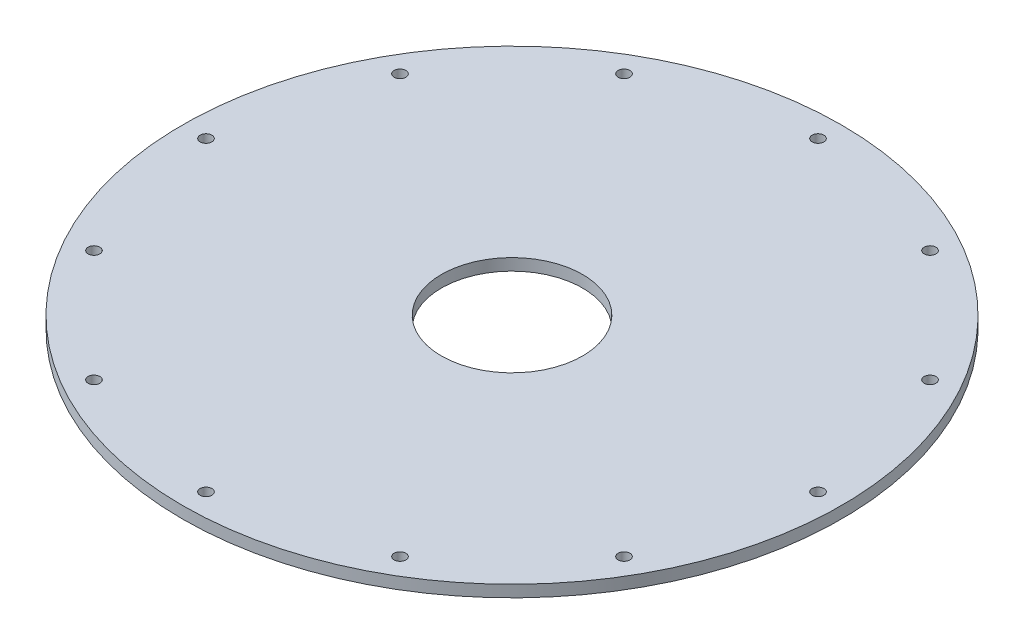
ISO-10303-21;
HEADER;
FILE_DESCRIPTION(('STEP AP214'),'2;1');
FILE_NAME('part.step','',(''),(''),'','','');
FILE_SCHEMA(('AUTOMOTIVE_DESIGN { 1 0 10303 214 1 1 1 1 }'));
ENDSEC;
DATA;
#1=APPLICATION_CONTEXT('core data for automotive mechanical design processes');
#2=APPLICATION_PROTOCOL_DEFINITION('international standard','automotive_design',2000,#1);
#3=PRODUCT_CONTEXT('',#1,'mechanical');
#4=PRODUCT('Part','Part','',(#3));
#5=PRODUCT_RELATED_PRODUCT_CATEGORY('part','',(#4));
#6=PRODUCT_DEFINITION_FORMATION('','',#4);
#7=PRODUCT_DEFINITION_CONTEXT('part definition',#1,'design');
#8=PRODUCT_DEFINITION('design','',#6,#7);
#9=PRODUCT_DEFINITION_SHAPE('','',#8);
#10=(LENGTH_UNIT() NAMED_UNIT(*) SI_UNIT(.MILLI.,.METRE.));
#11=(NAMED_UNIT(*) PLANE_ANGLE_UNIT() SI_UNIT($,.RADIAN.));
#12=(NAMED_UNIT(*) SI_UNIT($,.STERADIAN.) SOLID_ANGLE_UNIT());
#13=UNCERTAINTY_MEASURE_WITH_UNIT(LENGTH_MEASURE(1.E-05),#10,'distance_accuracy_value','');
#14=(GEOMETRIC_REPRESENTATION_CONTEXT(3) GLOBAL_UNCERTAINTY_ASSIGNED_CONTEXT((#13)) GLOBAL_UNIT_ASSIGNED_CONTEXT((#10,
#11,#12)) REPRESENTATION_CONTEXT('',''));
#15=CARTESIAN_POINT('',(0.,0.,0.));
#16=DIRECTION('',(0.,0.,1.));
#17=DIRECTION('',(1.,0.,0.));
#18=AXIS2_PLACEMENT_3D('',#15,#16,#17);
#19=CARTESIAN_POINT('',(-44.45,0.,0.));
#20=DIRECTION('',(0.,-1.,0.));
#21=DIRECTION('',(0.,0.,-1.));
#22=AXIS2_PLACEMENT_3D('',#19,#20,#21);
#23=PLANE('',#22);
#24=CARTESIAN_POINT('',(1.11561489392428E-13,0.,-41.275));
#25=DIRECTION('',(0.,1.,0.));
#26=DIRECTION('',(0.,0.,1.));
#27=AXIS2_PLACEMENT_3D('',#24,#25,#26);
#28=CIRCLE('',#27,0.79375);
#29=CARTESIAN_POINT('',(1.11561489392428E-13,0.,-40.48125));
#30=VERTEX_POINT('',#29);
#31=EDGE_CURVE('E69',#30,#30,#28,.T.);
#32=ORIENTED_EDGE('',*,*,#31,.T.);
#33=EDGE_LOOP('',(#32));
#34=FACE_BOUND('',#33,.T.);
#35=CARTESIAN_POINT('',(-20.6374999999999,0.,-35.7451985412027));
#36=DIRECTION('',(0.,1.,0.));
#37=DIRECTION('',(0.,0.,1.));
#38=AXIS2_PLACEMENT_3D('',#35,#36,#37);
#39=CIRCLE('',#38,0.793749999999999);
#40=CARTESIAN_POINT('',(-20.6374999999999,0.,-34.9514485412027));
#41=VERTEX_POINT('',#40);
#42=EDGE_CURVE('E63',#41,#41,#39,.T.);
#43=ORIENTED_EDGE('',*,*,#42,.T.);
#44=EDGE_LOOP('',(#43));
#45=FACE_BOUND('',#44,.T.);
#46=CARTESIAN_POINT('',(-35.7451985412027,0.,-20.6375));
#47=DIRECTION('',(0.,1.,0.));
#48=DIRECTION('',(0.,0.,1.));
#49=AXIS2_PLACEMENT_3D('',#46,#47,#48);
#50=CIRCLE('',#49,0.793750000000003);
#51=CARTESIAN_POINT('',(-35.7451985412027,0.,-19.84375));
#52=VERTEX_POINT('',#51);
#53=EDGE_CURVE('E57',#52,#52,#50,.T.);
#54=ORIENTED_EDGE('',*,*,#53,.T.);
#55=EDGE_LOOP('',(#54));
#56=FACE_BOUND('',#55,.T.);
#57=CARTESIAN_POINT('',(-41.275,0.,0.));
#58=DIRECTION('',(0.,1.,0.));
#59=DIRECTION('',(0.,0.,1.));
#60=AXIS2_PLACEMENT_3D('',#57,#58,#59);
#61=CIRCLE('',#60,0.793750000000003);
#62=CARTESIAN_POINT('',(-41.275,0.,0.793750000000008));
#63=VERTEX_POINT('',#62);
#64=EDGE_CURVE('E51',#63,#63,#61,.T.);
#65=ORIENTED_EDGE('',*,*,#64,.T.);
#66=EDGE_LOOP('',(#65));
#67=FACE_BOUND('',#66,.T.);
#68=CARTESIAN_POINT('',(0.,0.,0.));
#69=DIRECTION('',(0.,1.,0.));
#70=DIRECTION('',(0.,0.,1.));
#71=AXIS2_PLACEMENT_3D('',#68,#69,#70);
#72=CIRCLE('',#71,9.525);
#73=CARTESIAN_POINT('',(0.,0.,9.525));
#74=VERTEX_POINT('',#73);
#75=EDGE_CURVE('E42',#74,#74,#72,.T.);
#76=ORIENTED_EDGE('',*,*,#75,.T.);
#77=EDGE_LOOP('',(#76));
#78=FACE_BOUND('',#77,.T.);
#79=CARTESIAN_POINT('',(0.,0.,0.));
#80=DIRECTION('',(0.,1.,0.));
#81=DIRECTION('',(0.,0.,1.));
#82=AXIS2_PLACEMENT_3D('',#79,#80,#81);
#83=CIRCLE('',#82,44.45);
#84=CARTESIAN_POINT('',(0.,0.,44.45));
#85=VERTEX_POINT('',#84);
#86=EDGE_CURVE('E46',#85,#85,#83,.T.);
#87=ORIENTED_EDGE('',*,*,#86,.F.);
#88=EDGE_LOOP('',(#87));
#89=FACE_BOUND('',#88,.T.);
#90=CARTESIAN_POINT('',(20.6375000000001,0.,-35.7451985412026));
#91=DIRECTION('',(0.,1.,0.));
#92=DIRECTION('',(0.,0.,1.));
#93=AXIS2_PLACEMENT_3D('',#90,#91,#92);
#94=CIRCLE('',#93,0.793749999999999);
#95=CARTESIAN_POINT('',(20.6375000000001,0.,-34.9514485412026));
#96=VERTEX_POINT('',#95);
#97=EDGE_CURVE('E75',#96,#96,#94,.T.);
#98=ORIENTED_EDGE('',*,*,#97,.T.);
#99=EDGE_LOOP('',(#98));
#100=FACE_BOUND('',#99,.T.);
#101=CARTESIAN_POINT('',(35.7451985412028,0.,-20.6374999999998));
#102=DIRECTION('',(0.,1.,0.));
#103=DIRECTION('',(0.,0.,1.));
#104=AXIS2_PLACEMENT_3D('',#101,#102,#103);
#105=CIRCLE('',#104,0.793750000000003);
#106=CARTESIAN_POINT('',(35.7451985412028,0.,-19.8437499999998));
#107=VERTEX_POINT('',#106);
#108=EDGE_CURVE('E81',#107,#107,#105,.T.);
#109=ORIENTED_EDGE('',*,*,#108,.T.);
#110=EDGE_LOOP('',(#109));
#111=FACE_BOUND('',#110,.T.);
#112=CARTESIAN_POINT('',(41.275,0.,2.28177708448336E-13));
#113=DIRECTION('',(0.,1.,0.));
#114=DIRECTION('',(0.,0.,1.));
#115=AXIS2_PLACEMENT_3D('',#112,#113,#114);
#116=CIRCLE('',#115,0.793750000000003);
#117=CARTESIAN_POINT('',(41.275,0.,0.793750000000231));
#118=VERTEX_POINT('',#117);
#119=EDGE_CURVE('E87',#118,#118,#116,.T.);
#120=ORIENTED_EDGE('',*,*,#119,.T.);
#121=EDGE_LOOP('',(#120));
#122=FACE_BOUND('',#121,.T.);
#123=CARTESIAN_POINT('',(35.7451985412026,0.,20.6375000000002));
#124=DIRECTION('',(0.,1.,0.));
#125=DIRECTION('',(0.,0.,1.));
#126=AXIS2_PLACEMENT_3D('',#123,#124,#125);
#127=CIRCLE('',#126,0.793750000000003);
#128=CARTESIAN_POINT('',(35.7451985412026,0.,21.4312500000002));
#129=VERTEX_POINT('',#128);
#130=EDGE_CURVE('E93',#129,#129,#127,.T.);
#131=ORIENTED_EDGE('',*,*,#130,.T.);
#132=EDGE_LOOP('',(#131));
#133=FACE_BOUND('',#132,.T.);
#134=CARTESIAN_POINT('',(20.6374999999997,0.,35.7451985412029));
#135=DIRECTION('',(0.,1.,0.));
#136=DIRECTION('',(0.,0.,1.));
#137=AXIS2_PLACEMENT_3D('',#134,#135,#136);
#138=CIRCLE('',#137,0.793749999999999);
#139=CARTESIAN_POINT('',(20.6374999999997,0.,36.5389485412029));
#140=VERTEX_POINT('',#139);
#141=EDGE_CURVE('E99',#140,#140,#138,.T.);
#142=ORIENTED_EDGE('',*,*,#141,.T.);
#143=EDGE_LOOP('',(#142));
#144=FACE_BOUND('',#143,.T.);
#145=CARTESIAN_POINT('',(-3.53958818572525E-13,0.,41.275));
#146=DIRECTION('',(0.,1.,0.));
#147=DIRECTION('',(0.,0.,1.));
#148=AXIS2_PLACEMENT_3D('',#145,#146,#147);
#149=CIRCLE('',#148,0.79375);
#150=CARTESIAN_POINT('',(-3.53958818572525E-13,0.,42.06875));
#151=VERTEX_POINT('',#150);
#152=EDGE_CURVE('E105',#151,#151,#149,.T.);
#153=ORIENTED_EDGE('',*,*,#152,.T.);
#154=EDGE_LOOP('',(#153));
#155=FACE_BOUND('',#154,.T.);
#156=CARTESIAN_POINT('',(-20.6375000000004,0.,35.7451985412025));
#157=DIRECTION('',(0.,1.,0.));
#158=DIRECTION('',(0.,0.,1.));
#159=AXIS2_PLACEMENT_3D('',#156,#157,#158);
#160=CIRCLE('',#159,0.793749999999999);
#161=CARTESIAN_POINT('',(-20.6375000000004,0.,36.5389485412025));
#162=VERTEX_POINT('',#161);
#163=EDGE_CURVE('E111',#162,#162,#160,.T.);
#164=ORIENTED_EDGE('',*,*,#163,.T.);
#165=EDGE_LOOP('',(#164));
#166=FACE_BOUND('',#165,.T.);
#167=CARTESIAN_POINT('',(-35.7451985412029,0.,20.6374999999996));
#168=DIRECTION('',(0.,1.,0.));
#169=DIRECTION('',(0.,0.,1.));
#170=AXIS2_PLACEMENT_3D('',#167,#168,#169);
#171=CIRCLE('',#170,0.793750000000003);
#172=CARTESIAN_POINT('',(-35.7451985412029,0.,21.4312499999996));
#173=VERTEX_POINT('',#172);
#174=EDGE_CURVE('E117',#173,#173,#171,.T.);
#175=ORIENTED_EDGE('',*,*,#174,.T.);
#176=EDGE_LOOP('',(#175));
#177=FACE_BOUND('',#176,.T.);
#178=ADVANCED_FACE('F31',(#34,#45,#56,#67,#78,#89,#100,#111,#122,#133,#144,#155,#166,#177),#23,.T.);
#179=CARTESIAN_POINT('',(0.,55.,0.));
#180=DIRECTION('',(0.,1.,0.));
#181=DIRECTION('',(0.,0.,1.));
#182=AXIS2_PLACEMENT_3D('',#179,#180,#181);
#183=CYLINDRICAL_SURFACE('',#182,44.45);
#184=ORIENTED_EDGE('',*,*,#86,.T.);
#185=EDGE_LOOP('',(#184));
#186=FACE_BOUND('',#185,.T.);
#187=CARTESIAN_POINT('',(0.,1.5875,0.));
#188=DIRECTION('',(0.,1.,0.));
#189=DIRECTION('',(0.,0.,1.));
#190=AXIS2_PLACEMENT_3D('',#187,#188,#189);
#191=CIRCLE('',#190,44.45);
#192=CARTESIAN_POINT('',(0.,1.5875,44.45));
#193=VERTEX_POINT('',#192);
#194=EDGE_CURVE('E10',#193,#193,#191,.T.);
#195=ORIENTED_EDGE('',*,*,#194,.F.);
#196=EDGE_LOOP('',(#195));
#197=FACE_BOUND('',#196,.T.);
#198=ADVANCED_FACE('F33',(#186,#197),#183,.T.);
#199=CARTESIAN_POINT('',(-44.45,1.5875,0.));
#200=DIRECTION('',(0.,1.,0.));
#201=DIRECTION('',(0.,0.,1.));
#202=AXIS2_PLACEMENT_3D('',#199,#200,#201);
#203=PLANE('',#202);
#204=CARTESIAN_POINT('',(-35.7451985412029,1.5875,20.6374999999996));
#205=DIRECTION('',(0.,1.,0.));
#206=DIRECTION('',(0.,0.,1.));
#207=AXIS2_PLACEMENT_3D('',#204,#205,#206);
#208=CIRCLE('',#207,0.793750000000003);
#209=CARTESIAN_POINT('',(-35.7451985412029,1.5875,21.4312499999996));
#210=VERTEX_POINT('',#209);
#211=EDGE_CURVE('E120',#210,#210,#208,.T.);
#212=ORIENTED_EDGE('',*,*,#211,.F.);
#213=EDGE_LOOP('',(#212));
#214=FACE_BOUND('',#213,.T.);
#215=CARTESIAN_POINT('',(-20.6375000000004,1.5875,35.7451985412025));
#216=DIRECTION('',(0.,1.,0.));
#217=DIRECTION('',(0.,0.,1.));
#218=AXIS2_PLACEMENT_3D('',#215,#216,#217);
#219=CIRCLE('',#218,0.793749999999999);
#220=CARTESIAN_POINT('',(-20.6375000000004,1.5875,36.5389485412025));
#221=VERTEX_POINT('',#220);
#222=EDGE_CURVE('E114',#221,#221,#219,.T.);
#223=ORIENTED_EDGE('',*,*,#222,.F.);
#224=EDGE_LOOP('',(#223));
#225=FACE_BOUND('',#224,.T.);
#226=CARTESIAN_POINT('',(-3.53958818572525E-13,1.5875,41.275));
#227=DIRECTION('',(0.,1.,0.));
#228=DIRECTION('',(0.,0.,1.));
#229=AXIS2_PLACEMENT_3D('',#226,#227,#228);
#230=CIRCLE('',#229,0.79375);
#231=CARTESIAN_POINT('',(-3.53958818572525E-13,1.5875,42.06875));
#232=VERTEX_POINT('',#231);
#233=EDGE_CURVE('E108',#232,#232,#230,.T.);
#234=ORIENTED_EDGE('',*,*,#233,.F.);
#235=EDGE_LOOP('',(#234));
#236=FACE_BOUND('',#235,.T.);
#237=CARTESIAN_POINT('',(20.6374999999997,1.5875,35.7451985412029));
#238=DIRECTION('',(0.,1.,0.));
#239=DIRECTION('',(0.,0.,1.));
#240=AXIS2_PLACEMENT_3D('',#237,#238,#239);
#241=CIRCLE('',#240,0.793749999999999);
#242=CARTESIAN_POINT('',(20.6374999999997,1.5875,36.5389485412029));
#243=VERTEX_POINT('',#242);
#244=EDGE_CURVE('E102',#243,#243,#241,.T.);
#245=ORIENTED_EDGE('',*,*,#244,.F.);
#246=EDGE_LOOP('',(#245));
#247=FACE_BOUND('',#246,.T.);
#248=CARTESIAN_POINT('',(35.7451985412026,1.5875,20.6375000000002));
#249=DIRECTION('',(0.,1.,0.));
#250=DIRECTION('',(0.,0.,1.));
#251=AXIS2_PLACEMENT_3D('',#248,#249,#250);
#252=CIRCLE('',#251,0.793750000000003);
#253=CARTESIAN_POINT('',(35.7451985412026,1.5875,21.4312500000002));
#254=VERTEX_POINT('',#253);
#255=EDGE_CURVE('E96',#254,#254,#252,.T.);
#256=ORIENTED_EDGE('',*,*,#255,.F.);
#257=EDGE_LOOP('',(#256));
#258=FACE_BOUND('',#257,.T.);
#259=CARTESIAN_POINT('',(41.275,1.5875,2.28177708448336E-13));
#260=DIRECTION('',(0.,1.,0.));
#261=DIRECTION('',(0.,0.,1.));
#262=AXIS2_PLACEMENT_3D('',#259,#260,#261);
#263=CIRCLE('',#262,0.793750000000003);
#264=CARTESIAN_POINT('',(41.275,1.5875,0.793750000000231));
#265=VERTEX_POINT('',#264);
#266=EDGE_CURVE('E90',#265,#265,#263,.T.);
#267=ORIENTED_EDGE('',*,*,#266,.F.);
#268=EDGE_LOOP('',(#267));
#269=FACE_BOUND('',#268,.T.);
#270=CARTESIAN_POINT('',(35.7451985412028,1.5875,-20.6374999999998));
#271=DIRECTION('',(0.,1.,0.));
#272=DIRECTION('',(0.,0.,1.));
#273=AXIS2_PLACEMENT_3D('',#270,#271,#272);
#274=CIRCLE('',#273,0.793750000000003);
#275=CARTESIAN_POINT('',(35.7451985412028,1.5875,-19.8437499999998));
#276=VERTEX_POINT('',#275);
#277=EDGE_CURVE('E84',#276,#276,#274,.T.);
#278=ORIENTED_EDGE('',*,*,#277,.F.);
#279=EDGE_LOOP('',(#278));
#280=FACE_BOUND('',#279,.T.);
#281=CARTESIAN_POINT('',(20.6375000000001,1.5875,-35.7451985412026));
#282=DIRECTION('',(0.,1.,0.));
#283=DIRECTION('',(0.,0.,1.));
#284=AXIS2_PLACEMENT_3D('',#281,#282,#283);
#285=CIRCLE('',#284,0.793749999999999);
#286=CARTESIAN_POINT('',(20.6375000000001,1.5875,-34.9514485412026));
#287=VERTEX_POINT('',#286);
#288=EDGE_CURVE('E78',#287,#287,#285,.T.);
#289=ORIENTED_EDGE('',*,*,#288,.F.);
#290=EDGE_LOOP('',(#289));
#291=FACE_BOUND('',#290,.T.);
#292=CARTESIAN_POINT('',(1.11561489392428E-13,1.5875,-41.275));
#293=DIRECTION('',(0.,1.,0.));
#294=DIRECTION('',(0.,0.,1.));
#295=AXIS2_PLACEMENT_3D('',#292,#293,#294);
#296=CIRCLE('',#295,0.79375);
#297=CARTESIAN_POINT('',(1.11561489392428E-13,1.5875,-40.48125));
#298=VERTEX_POINT('',#297);
#299=EDGE_CURVE('E72',#298,#298,#296,.T.);
#300=ORIENTED_EDGE('',*,*,#299,.F.);
#301=EDGE_LOOP('',(#300));
#302=FACE_BOUND('',#301,.T.);
#303=CARTESIAN_POINT('',(-20.6374999999999,1.5875,-35.7451985412027));
#304=DIRECTION('',(0.,1.,0.));
#305=DIRECTION('',(0.,0.,1.));
#306=AXIS2_PLACEMENT_3D('',#303,#304,#305);
#307=CIRCLE('',#306,0.793749999999999);
#308=CARTESIAN_POINT('',(-20.6374999999999,1.5875,-34.9514485412027));
#309=VERTEX_POINT('',#308);
#310=EDGE_CURVE('E66',#309,#309,#307,.T.);
#311=ORIENTED_EDGE('',*,*,#310,.F.);
#312=EDGE_LOOP('',(#311));
#313=FACE_BOUND('',#312,.T.);
#314=CARTESIAN_POINT('',(-35.7451985412027,1.5875,-20.6375));
#315=DIRECTION('',(0.,1.,0.));
#316=DIRECTION('',(0.,0.,1.));
#317=AXIS2_PLACEMENT_3D('',#314,#315,#316);
#318=CIRCLE('',#317,0.793750000000003);
#319=CARTESIAN_POINT('',(-35.7451985412027,1.5875,-19.84375));
#320=VERTEX_POINT('',#319);
#321=EDGE_CURVE('E60',#320,#320,#318,.T.);
#322=ORIENTED_EDGE('',*,*,#321,.F.);
#323=EDGE_LOOP('',(#322));
#324=FACE_BOUND('',#323,.T.);
#325=CARTESIAN_POINT('',(-41.275,1.5875,0.));
#326=DIRECTION('',(0.,1.,0.));
#327=DIRECTION('',(0.,0.,1.));
#328=AXIS2_PLACEMENT_3D('',#325,#326,#327);
#329=CIRCLE('',#328,0.793750000000003);
#330=CARTESIAN_POINT('',(-41.275,1.5875,0.793750000000008));
#331=VERTEX_POINT('',#330);
#332=EDGE_CURVE('E54',#331,#331,#329,.T.);
#333=ORIENTED_EDGE('',*,*,#332,.F.);
#334=EDGE_LOOP('',(#333));
#335=FACE_BOUND('',#334,.T.);
#336=ORIENTED_EDGE('',*,*,#194,.T.);
#337=EDGE_LOOP('',(#336));
#338=FACE_BOUND('',#337,.T.);
#339=CARTESIAN_POINT('',(0.,1.5875,0.));
#340=DIRECTION('',(0.,1.,0.));
#341=DIRECTION('',(0.,0.,1.));
#342=AXIS2_PLACEMENT_3D('',#339,#340,#341);
#343=CIRCLE('',#342,9.525);
#344=CARTESIAN_POINT('',(0.,1.5875,9.525));
#345=VERTEX_POINT('',#344);
#346=EDGE_CURVE('E38',#345,#345,#343,.T.);
#347=ORIENTED_EDGE('',*,*,#346,.F.);
#348=EDGE_LOOP('',(#347));
#349=FACE_BOUND('',#348,.T.);
#350=ADVANCED_FACE('F126',(#214,#225,#236,#247,#258,#269,#280,#291,#302,#313,#324,#335,#338,
#349),#203,.T.);
#351=CARTESIAN_POINT('',(0.,55.,0.));
#352=DIRECTION('',(0.,1.,0.));
#353=DIRECTION('',(0.,0.,1.));
#354=AXIS2_PLACEMENT_3D('',#351,#352,#353);
#355=CYLINDRICAL_SURFACE('',#354,9.525);
#356=ORIENTED_EDGE('',*,*,#346,.T.);
#357=EDGE_LOOP('',(#356));
#358=FACE_BOUND('',#357,.T.);
#359=ORIENTED_EDGE('',*,*,#75,.F.);
#360=EDGE_LOOP('',(#359));
#361=FACE_BOUND('',#360,.T.);
#362=ADVANCED_FACE('F129',(#358,#361),#355,.F.);
#363=CARTESIAN_POINT('',(-41.275,1.5875,0.));
#364=DIRECTION('',(0.,1.,0.));
#365=DIRECTION('',(0.,0.,1.));
#366=AXIS2_PLACEMENT_3D('',#363,#364,#365);
#367=CYLINDRICAL_SURFACE('',#366,0.793750000000003);
#368=ORIENTED_EDGE('',*,*,#64,.F.);
#369=EDGE_LOOP('',(#368));
#370=FACE_BOUND('',#369,.T.);
#371=ORIENTED_EDGE('',*,*,#332,.T.);
#372=EDGE_LOOP('',(#371));
#373=FACE_BOUND('',#372,.T.);
#374=ADVANCED_FACE('F153',(#370,#373),#367,.F.);
#375=CARTESIAN_POINT('',(-35.7451985412027,1.5875,-20.6375));
#376=DIRECTION('',(0.,1.,0.));
#377=DIRECTION('',(0.,0.,1.));
#378=AXIS2_PLACEMENT_3D('',#375,#376,#377);
#379=CYLINDRICAL_SURFACE('',#378,0.793750000000003);
#380=ORIENTED_EDGE('',*,*,#53,.F.);
#381=EDGE_LOOP('',(#380));
#382=FACE_BOUND('',#381,.T.);
#383=ORIENTED_EDGE('',*,*,#321,.T.);
#384=EDGE_LOOP('',(#383));
#385=FACE_BOUND('',#384,.T.);
#386=ADVANCED_FACE('F155',(#382,#385),#379,.F.);
#387=CARTESIAN_POINT('',(-20.6374999999999,1.5875,-35.7451985412027));
#388=DIRECTION('',(0.,1.,0.));
#389=DIRECTION('',(0.,0.,1.));
#390=AXIS2_PLACEMENT_3D('',#387,#388,#389);
#391=CYLINDRICAL_SURFACE('',#390,0.793749999999999);
#392=ORIENTED_EDGE('',*,*,#42,.F.);
#393=EDGE_LOOP('',(#392));
#394=FACE_BOUND('',#393,.T.);
#395=ORIENTED_EDGE('',*,*,#310,.T.);
#396=EDGE_LOOP('',(#395));
#397=FACE_BOUND('',#396,.T.);
#398=ADVANCED_FACE('F162',(#394,#397),#391,.F.);
#399=CARTESIAN_POINT('',(1.11561489392428E-13,1.5875,-41.275));
#400=DIRECTION('',(0.,1.,0.));
#401=DIRECTION('',(0.,0.,1.));
#402=AXIS2_PLACEMENT_3D('',#399,#400,#401);
#403=CYLINDRICAL_SURFACE('',#402,0.79375);
#404=ORIENTED_EDGE('',*,*,#31,.F.);
#405=EDGE_LOOP('',(#404));
#406=FACE_BOUND('',#405,.T.);
#407=ORIENTED_EDGE('',*,*,#299,.T.);
#408=EDGE_LOOP('',(#407));
#409=FACE_BOUND('',#408,.T.);
#410=ADVANCED_FACE('F233',(#406,#409),#403,.F.);
#411=CARTESIAN_POINT('',(20.6375000000001,1.5875,-35.7451985412026));
#412=DIRECTION('',(0.,1.,0.));
#413=DIRECTION('',(0.,0.,1.));
#414=AXIS2_PLACEMENT_3D('',#411,#412,#413);
#415=CYLINDRICAL_SURFACE('',#414,0.793749999999999);
#416=ORIENTED_EDGE('',*,*,#97,.F.);
#417=EDGE_LOOP('',(#416));
#418=FACE_BOUND('',#417,.T.);
#419=ORIENTED_EDGE('',*,*,#288,.T.);
#420=EDGE_LOOP('',(#419));
#421=FACE_BOUND('',#420,.T.);
#422=ADVANCED_FACE('F229',(#418,#421),#415,.F.);
#423=CARTESIAN_POINT('',(35.7451985412028,1.5875,-20.6374999999998));
#424=DIRECTION('',(0.,1.,0.));
#425=DIRECTION('',(0.,0.,1.));
#426=AXIS2_PLACEMENT_3D('',#423,#424,#425);
#427=CYLINDRICAL_SURFACE('',#426,0.793750000000003);
#428=ORIENTED_EDGE('',*,*,#108,.F.);
#429=EDGE_LOOP('',(#428));
#430=FACE_BOUND('',#429,.T.);
#431=ORIENTED_EDGE('',*,*,#277,.T.);
#432=EDGE_LOOP('',(#431));
#433=FACE_BOUND('',#432,.T.);
#434=ADVANCED_FACE('F225',(#430,#433),#427,.F.);
#435=CARTESIAN_POINT('',(41.275,1.5875,2.28177708448336E-13));
#436=DIRECTION('',(0.,1.,0.));
#437=DIRECTION('',(0.,0.,1.));
#438=AXIS2_PLACEMENT_3D('',#435,#436,#437);
#439=CYLINDRICAL_SURFACE('',#438,0.793750000000003);
#440=ORIENTED_EDGE('',*,*,#119,.F.);
#441=EDGE_LOOP('',(#440));
#442=FACE_BOUND('',#441,.T.);
#443=ORIENTED_EDGE('',*,*,#266,.T.);
#444=EDGE_LOOP('',(#443));
#445=FACE_BOUND('',#444,.T.);
#446=ADVANCED_FACE('F221',(#442,#445),#439,.F.);
#447=CARTESIAN_POINT('',(35.7451985412026,1.5875,20.6375000000002));
#448=DIRECTION('',(0.,1.,0.));
#449=DIRECTION('',(0.,0.,1.));
#450=AXIS2_PLACEMENT_3D('',#447,#448,#449);
#451=CYLINDRICAL_SURFACE('',#450,0.793750000000003);
#452=ORIENTED_EDGE('',*,*,#130,.F.);
#453=EDGE_LOOP('',(#452));
#454=FACE_BOUND('',#453,.T.);
#455=ORIENTED_EDGE('',*,*,#255,.T.);
#456=EDGE_LOOP('',(#455));
#457=FACE_BOUND('',#456,.T.);
#458=ADVANCED_FACE('F217',(#454,#457),#451,.F.);
#459=CARTESIAN_POINT('',(20.6374999999997,1.5875,35.7451985412029));
#460=DIRECTION('',(0.,1.,0.));
#461=DIRECTION('',(0.,0.,1.));
#462=AXIS2_PLACEMENT_3D('',#459,#460,#461);
#463=CYLINDRICAL_SURFACE('',#462,0.793749999999999);
#464=ORIENTED_EDGE('',*,*,#141,.F.);
#465=EDGE_LOOP('',(#464));
#466=FACE_BOUND('',#465,.T.);
#467=ORIENTED_EDGE('',*,*,#244,.T.);
#468=EDGE_LOOP('',(#467));
#469=FACE_BOUND('',#468,.T.);
#470=ADVANCED_FACE('F213',(#466,#469),#463,.F.);
#471=CARTESIAN_POINT('',(-3.53958818572525E-13,1.5875,41.275));
#472=DIRECTION('',(0.,1.,0.));
#473=DIRECTION('',(0.,0.,1.));
#474=AXIS2_PLACEMENT_3D('',#471,#472,#473);
#475=CYLINDRICAL_SURFACE('',#474,0.79375);
#476=ORIENTED_EDGE('',*,*,#152,.F.);
#477=EDGE_LOOP('',(#476));
#478=FACE_BOUND('',#477,.T.);
#479=ORIENTED_EDGE('',*,*,#233,.T.);
#480=EDGE_LOOP('',(#479));
#481=FACE_BOUND('',#480,.T.);
#482=ADVANCED_FACE('F207',(#478,#481),#475,.F.);
#483=CARTESIAN_POINT('',(-20.6375000000004,1.5875,35.7451985412025));
#484=DIRECTION('',(0.,1.,0.));
#485=DIRECTION('',(0.,0.,1.));
#486=AXIS2_PLACEMENT_3D('',#483,#484,#485);
#487=CYLINDRICAL_SURFACE('',#486,0.793749999999999);
#488=ORIENTED_EDGE('',*,*,#163,.F.);
#489=EDGE_LOOP('',(#488));
#490=FACE_BOUND('',#489,.T.);
#491=ORIENTED_EDGE('',*,*,#222,.T.);
#492=EDGE_LOOP('',(#491));
#493=FACE_BOUND('',#492,.T.);
#494=ADVANCED_FACE('F202',(#490,#493),#487,.F.);
#495=CARTESIAN_POINT('',(-35.7451985412029,1.5875,20.6374999999996));
#496=DIRECTION('',(0.,1.,0.));
#497=DIRECTION('',(0.,0.,1.));
#498=AXIS2_PLACEMENT_3D('',#495,#496,#497);
#499=CYLINDRICAL_SURFACE('',#498,0.793750000000003);
#500=ORIENTED_EDGE('',*,*,#174,.F.);
#501=EDGE_LOOP('',(#500));
#502=FACE_BOUND('',#501,.T.);
#503=ORIENTED_EDGE('',*,*,#211,.T.);
#504=EDGE_LOOP('',(#503));
#505=FACE_BOUND('',#504,.T.);
#506=ADVANCED_FACE('F124',(#502,#505),#499,.F.);
#507=CLOSED_SHELL('',(#178,#198,#350,#362,#374,#386,#398,#410,#422,#434,#446,#458,#470,#482,
#494,#506));
#508=MANIFOLD_SOLID_BREP('B2',#507);
#509=ADVANCED_BREP_SHAPE_REPRESENTATION('',(#18,#508),#14);
#510=SHAPE_DEFINITION_REPRESENTATION(#9,#509);
ENDSEC;
END-ISO-10303-21;
